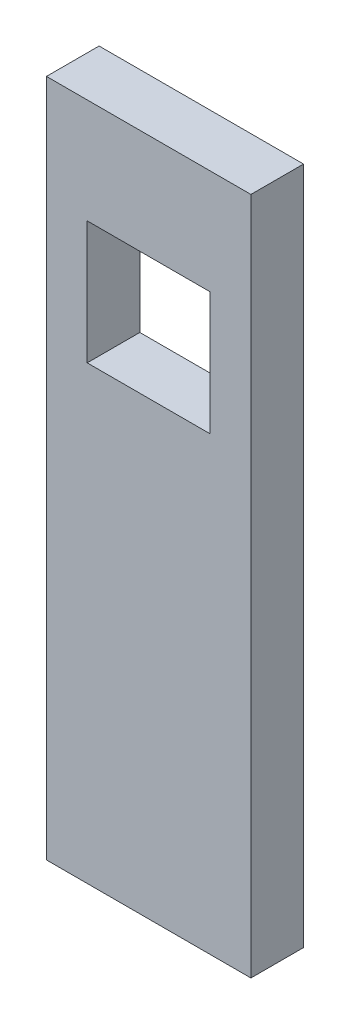
ISO-10303-21;
HEADER;
FILE_DESCRIPTION(('STEP AP214'),'2;1');
FILE_NAME('part.step','',(''),(''),'','','');
FILE_SCHEMA(('AUTOMOTIVE_DESIGN { 1 0 10303 214 1 1 1 1 }'));
ENDSEC;
DATA;
#1=APPLICATION_CONTEXT('core data for automotive mechanical design processes');
#2=APPLICATION_PROTOCOL_DEFINITION('international standard','automotive_design',2000,#1);
#3=PRODUCT_CONTEXT('',#1,'mechanical');
#4=PRODUCT('Part','Part','',(#3));
#5=PRODUCT_RELATED_PRODUCT_CATEGORY('part','',(#4));
#6=PRODUCT_DEFINITION_FORMATION('','',#4);
#7=PRODUCT_DEFINITION_CONTEXT('part definition',#1,'design');
#8=PRODUCT_DEFINITION('design','',#6,#7);
#9=PRODUCT_DEFINITION_SHAPE('','',#8);
#10=(LENGTH_UNIT() NAMED_UNIT(*) SI_UNIT(.MILLI.,.METRE.));
#11=(NAMED_UNIT(*) PLANE_ANGLE_UNIT() SI_UNIT($,.RADIAN.));
#12=(NAMED_UNIT(*) SI_UNIT($,.STERADIAN.) SOLID_ANGLE_UNIT());
#13=UNCERTAINTY_MEASURE_WITH_UNIT(LENGTH_MEASURE(1.E-05),#10,'distance_accuracy_value','');
#14=(GEOMETRIC_REPRESENTATION_CONTEXT(3) GLOBAL_UNCERTAINTY_ASSIGNED_CONTEXT((#13)) GLOBAL_UNIT_ASSIGNED_CONTEXT((#10,
#11,#12)) REPRESENTATION_CONTEXT('',''));
#15=CARTESIAN_POINT('',(0.,0.,0.));
#16=DIRECTION('',(0.,0.,1.));
#17=DIRECTION('',(1.,0.,0.));
#18=AXIS2_PLACEMENT_3D('',#15,#16,#17);
#19=CARTESIAN_POINT('',(0.,0.,2.6));
#20=DIRECTION('',(0.,0.,-1.));
#21=DIRECTION('',(-1.,0.,0.));
#22=AXIS2_PLACEMENT_3D('',#19,#20,#21);
#23=PLANE('',#22);
#24=DIRECTION('',(0.,-1.,0.));
#25=VECTOR('',#24,1.);
#26=CARTESIAN_POINT('',(-0.100000000000003,66.95,2.6));
#27=LINE('',#26,#25);
#28=CARTESIAN_POINT('',(-0.100000000000003,66.95,2.6));
#29=VERTEX_POINT('',#28);
#30=CARTESIAN_POINT('',(-0.0999999999999994,-0.100000000000003,2.6));
#31=VERTEX_POINT('',#30);
#32=EDGE_CURVE('E134',#29,#31,#27,.T.);
#33=ORIENTED_EDGE('',*,*,#32,.T.);
#34=DIRECTION('',(1.,0.,0.));
#35=VECTOR('',#34,1.);
#36=CARTESIAN_POINT('',(20.1,-0.100000000000003,2.6));
#37=LINE('',#36,#35);
#38=CARTESIAN_POINT('',(20.1,-0.100000000000003,2.6));
#39=VERTEX_POINT('',#38);
#40=EDGE_CURVE('E136',#31,#39,#37,.T.);
#41=ORIENTED_EDGE('',*,*,#40,.T.);
#42=DIRECTION('',(0.,1.,0.));
#43=VECTOR('',#42,1.);
#44=CARTESIAN_POINT('',(20.1,22.3,2.6));
#45=LINE('',#44,#43);
#46=CARTESIAN_POINT('',(20.1,66.95,2.6));
#47=VERTEX_POINT('',#46);
#48=EDGE_CURVE('E139',#39,#47,#45,.T.);
#49=ORIENTED_EDGE('',*,*,#48,.T.);
#50=DIRECTION('',(-1.,0.,0.));
#51=VECTOR('',#50,1.);
#52=CARTESIAN_POINT('',(-0.100000000000003,66.95,2.6));
#53=LINE('',#52,#51);
#54=EDGE_CURVE('E141',#47,#29,#53,.T.);
#55=ORIENTED_EDGE('',*,*,#54,.T.);
#56=EDGE_LOOP('',(#33,#41,#49,#55));
#57=FACE_BOUND('',#56,.T.);
#58=DIRECTION('',(0.,-1.,0.));
#59=VECTOR('',#58,1.);
#60=CARTESIAN_POINT('',(3.925,56.6,2.6));
#61=LINE('',#60,#59);
#62=CARTESIAN_POINT('',(3.925,56.6,2.6));
#63=VERTEX_POINT('',#62);
#64=CARTESIAN_POINT('',(3.925,44.45,2.6));
#65=VERTEX_POINT('',#64);
#66=EDGE_CURVE('E98',#63,#65,#61,.T.);
#67=ORIENTED_EDGE('',*,*,#66,.F.);
#68=DIRECTION('',(-1.,0.,0.));
#69=VECTOR('',#68,1.);
#70=CARTESIAN_POINT('',(3.925,56.6,2.6));
#71=LINE('',#70,#69);
#72=CARTESIAN_POINT('',(16.075,56.6,2.6));
#73=VERTEX_POINT('',#72);
#74=EDGE_CURVE('E120',#73,#63,#71,.T.);
#75=ORIENTED_EDGE('',*,*,#74,.F.);
#76=DIRECTION('',(0.,1.,0.));
#77=VECTOR('',#76,1.);
#78=CARTESIAN_POINT('',(16.075,56.6,2.6));
#79=LINE('',#78,#77);
#80=CARTESIAN_POINT('',(16.075,44.45,2.6));
#81=VERTEX_POINT('',#80);
#82=EDGE_CURVE('E118',#81,#73,#79,.T.);
#83=ORIENTED_EDGE('',*,*,#82,.F.);
#84=DIRECTION('',(1.,0.,0.));
#85=VECTOR('',#84,1.);
#86=CARTESIAN_POINT('',(3.925,44.45,2.6));
#87=LINE('',#86,#85);
#88=EDGE_CURVE('E106',#65,#81,#87,.T.);
#89=ORIENTED_EDGE('',*,*,#88,.F.);
#90=EDGE_LOOP('',(#67,#75,#83,#89));
#91=FACE_BOUND('',#90,.T.);
#92=ADVANCED_FACE('F33',(#57,#91),#23,.F.);
#93=CARTESIAN_POINT('',(0.,0.,-2.6));
#94=DIRECTION('',(0.,0.,-1.));
#95=DIRECTION('',(-1.,0.,0.));
#96=AXIS2_PLACEMENT_3D('',#93,#94,#95);
#97=PLANE('',#96);
#98=DIRECTION('',(0.,-1.,0.));
#99=VECTOR('',#98,1.);
#100=CARTESIAN_POINT('',(-0.0999999999999994,22.3,-2.6));
#101=LINE('',#100,#99);
#102=CARTESIAN_POINT('',(-0.100000000000003,66.95,-2.6));
#103=VERTEX_POINT('',#102);
#104=CARTESIAN_POINT('',(-0.0999999999999994,-0.100000000000003,-2.6));
#105=VERTEX_POINT('',#104);
#106=EDGE_CURVE('E114',#103,#105,#101,.T.);
#107=ORIENTED_EDGE('',*,*,#106,.F.);
#108=DIRECTION('',(-1.,0.,0.));
#109=VECTOR('',#108,1.);
#110=CARTESIAN_POINT('',(-0.100000000000003,66.95,-2.6));
#111=LINE('',#110,#109);
#112=CARTESIAN_POINT('',(20.1,66.95,-2.6));
#113=VERTEX_POINT('',#112);
#114=EDGE_CURVE('E137',#113,#103,#111,.T.);
#115=ORIENTED_EDGE('',*,*,#114,.F.);
#116=DIRECTION('',(0.,1.,0.));
#117=VECTOR('',#116,1.);
#118=CARTESIAN_POINT('',(20.1,66.95,-2.6));
#119=LINE('',#118,#117);
#120=CARTESIAN_POINT('',(20.1,-0.100000000000003,-2.6));
#121=VERTEX_POINT('',#120);
#122=EDGE_CURVE('E148',#121,#113,#119,.T.);
#123=ORIENTED_EDGE('',*,*,#122,.F.);
#124=DIRECTION('',(1.,0.,0.));
#125=VECTOR('',#124,1.);
#126=CARTESIAN_POINT('',(20.1,-0.100000000000003,-2.6));
#127=LINE('',#126,#125);
#128=EDGE_CURVE('E145',#105,#121,#127,.T.);
#129=ORIENTED_EDGE('',*,*,#128,.F.);
#130=EDGE_LOOP('',(#107,#115,#123,#129));
#131=FACE_BOUND('',#130,.T.);
#132=DIRECTION('',(-1.,0.,0.));
#133=VECTOR('',#132,1.);
#134=CARTESIAN_POINT('',(3.925,56.6,-2.6));
#135=LINE('',#134,#133);
#136=CARTESIAN_POINT('',(16.075,56.6,-2.6));
#137=VERTEX_POINT('',#136);
#138=CARTESIAN_POINT('',(3.925,56.6,-2.6));
#139=VERTEX_POINT('',#138);
#140=EDGE_CURVE('E107',#137,#139,#135,.T.);
#141=ORIENTED_EDGE('',*,*,#140,.T.);
#142=DIRECTION('',(0.,-1.,0.));
#143=VECTOR('',#142,1.);
#144=CARTESIAN_POINT('',(3.925,56.6,-2.6));
#145=LINE('',#144,#143);
#146=CARTESIAN_POINT('',(3.925,44.45,-2.6));
#147=VERTEX_POINT('',#146);
#148=EDGE_CURVE('E56',#139,#147,#145,.T.);
#149=ORIENTED_EDGE('',*,*,#148,.T.);
#150=DIRECTION('',(1.,0.,0.));
#151=VECTOR('',#150,1.);
#152=CARTESIAN_POINT('',(3.925,44.45,-2.6));
#153=LINE('',#152,#151);
#154=CARTESIAN_POINT('',(16.075,44.45,-2.6));
#155=VERTEX_POINT('',#154);
#156=EDGE_CURVE('E113',#147,#155,#153,.T.);
#157=ORIENTED_EDGE('',*,*,#156,.T.);
#158=DIRECTION('',(0.,1.,0.));
#159=VECTOR('',#158,1.);
#160=CARTESIAN_POINT('',(16.075,56.6,-2.6));
#161=LINE('',#160,#159);
#162=EDGE_CURVE('E126',#155,#137,#161,.T.);
#163=ORIENTED_EDGE('',*,*,#162,.T.);
#164=EDGE_LOOP('',(#141,#149,#157,#163));
#165=FACE_BOUND('',#164,.T.);
#166=ADVANCED_FACE('F168',(#131,#165),#97,.T.);
#167=CARTESIAN_POINT('',(-0.0999999999999994,22.3,2.6));
#168=DIRECTION('',(1.,0.,0.));
#169=DIRECTION('',(0.,0.,-1.));
#170=AXIS2_PLACEMENT_3D('',#167,#168,#169);
#171=PLANE('',#170);
#172=ORIENTED_EDGE('',*,*,#106,.T.);
#173=DIRECTION('',(0.,0.,-1.));
#174=VECTOR('',#173,1.);
#175=CARTESIAN_POINT('',(-0.0999999999999994,-0.100000000000003,2.6));
#176=LINE('',#175,#174);
#177=EDGE_CURVE('E11',#31,#105,#176,.T.);
#178=ORIENTED_EDGE('',*,*,#177,.F.);
#179=ORIENTED_EDGE('',*,*,#32,.F.);
#180=DIRECTION('',(0.,0.,-1.));
#181=VECTOR('',#180,1.);
#182=CARTESIAN_POINT('',(-0.100000000000003,66.95,2.6));
#183=LINE('',#182,#181);
#184=EDGE_CURVE('E143',#29,#103,#183,.T.);
#185=ORIENTED_EDGE('',*,*,#184,.T.);
#186=EDGE_LOOP('',(#172,#178,#179,#185));
#187=FACE_BOUND('',#186,.T.);
#188=ADVANCED_FACE('F35',(#187),#171,.F.);
#189=CARTESIAN_POINT('',(20.1,-0.100000000000003,2.6));
#190=DIRECTION('',(0.,1.,0.));
#191=DIRECTION('',(-1.,0.,0.));
#192=AXIS2_PLACEMENT_3D('',#189,#190,#191);
#193=PLANE('',#192);
#194=ORIENTED_EDGE('',*,*,#128,.T.);
#195=DIRECTION('',(0.,0.,-1.));
#196=VECTOR('',#195,1.);
#197=CARTESIAN_POINT('',(20.1,-0.100000000000003,2.6));
#198=LINE('',#197,#196);
#199=EDGE_CURVE('E41',#39,#121,#198,.T.);
#200=ORIENTED_EDGE('',*,*,#199,.F.);
#201=ORIENTED_EDGE('',*,*,#40,.F.);
#202=ORIENTED_EDGE('',*,*,#177,.T.);
#203=EDGE_LOOP('',(#194,#200,#201,#202));
#204=FACE_BOUND('',#203,.T.);
#205=ADVANCED_FACE('F164',(#204),#193,.F.);
#206=CARTESIAN_POINT('',(20.1,66.95,2.6));
#207=DIRECTION('',(-1.,0.,0.));
#208=DIRECTION('',(0.,0.,1.));
#209=AXIS2_PLACEMENT_3D('',#206,#207,#208);
#210=PLANE('',#209);
#211=ORIENTED_EDGE('',*,*,#122,.T.);
#212=DIRECTION('',(0.,0.,-1.));
#213=VECTOR('',#212,1.);
#214=CARTESIAN_POINT('',(20.1,66.95,2.6));
#215=LINE('',#214,#213);
#216=EDGE_CURVE('E154',#47,#113,#215,.T.);
#217=ORIENTED_EDGE('',*,*,#216,.F.);
#218=ORIENTED_EDGE('',*,*,#48,.F.);
#219=ORIENTED_EDGE('',*,*,#199,.T.);
#220=EDGE_LOOP('',(#211,#217,#218,#219));
#221=FACE_BOUND('',#220,.T.);
#222=ADVANCED_FACE('F160',(#221),#210,.F.);
#223=CARTESIAN_POINT('',(-0.100000000000003,66.95,2.6));
#224=DIRECTION('',(0.,-1.,0.));
#225=DIRECTION('',(0.,0.,-1.));
#226=AXIS2_PLACEMENT_3D('',#223,#224,#225);
#227=PLANE('',#226);
#228=ORIENTED_EDGE('',*,*,#114,.T.);
#229=ORIENTED_EDGE('',*,*,#184,.F.);
#230=ORIENTED_EDGE('',*,*,#54,.F.);
#231=ORIENTED_EDGE('',*,*,#216,.T.);
#232=EDGE_LOOP('',(#228,#229,#230,#231));
#233=FACE_BOUND('',#232,.T.);
#234=ADVANCED_FACE('F173',(#233),#227,.F.);
#235=CARTESIAN_POINT('',(3.925,56.6,2.6));
#236=DIRECTION('',(1.,0.,0.));
#237=DIRECTION('',(0.,1.,0.));
#238=AXIS2_PLACEMENT_3D('',#235,#236,#237);
#239=PLANE('',#238);
#240=ORIENTED_EDGE('',*,*,#148,.F.);
#241=DIRECTION('',(0.,0.,-1.));
#242=VECTOR('',#241,1.);
#243=CARTESIAN_POINT('',(3.925,56.6,2.6));
#244=LINE('',#243,#242);
#245=EDGE_CURVE('E102',#63,#139,#244,.T.);
#246=ORIENTED_EDGE('',*,*,#245,.F.);
#247=ORIENTED_EDGE('',*,*,#66,.T.);
#248=DIRECTION('',(0.,0.,-1.));
#249=VECTOR('',#248,1.);
#250=CARTESIAN_POINT('',(3.925,44.45,2.6));
#251=LINE('',#250,#249);
#252=EDGE_CURVE('E101',#65,#147,#251,.T.);
#253=ORIENTED_EDGE('',*,*,#252,.T.);
#254=EDGE_LOOP('',(#240,#246,#247,#253));
#255=FACE_BOUND('',#254,.T.);
#256=ADVANCED_FACE('F100',(#255),#239,.T.);
#257=CARTESIAN_POINT('',(3.925,44.45,2.6));
#258=DIRECTION('',(0.,1.,0.));
#259=DIRECTION('',(0.,0.,1.));
#260=AXIS2_PLACEMENT_3D('',#257,#258,#259);
#261=PLANE('',#260);
#262=ORIENTED_EDGE('',*,*,#156,.F.);
#263=ORIENTED_EDGE('',*,*,#252,.F.);
#264=ORIENTED_EDGE('',*,*,#88,.T.);
#265=DIRECTION('',(0.,0.,-1.));
#266=VECTOR('',#265,1.);
#267=CARTESIAN_POINT('',(16.075,44.45,2.6));
#268=LINE('',#267,#266);
#269=EDGE_CURVE('E115',#81,#155,#268,.T.);
#270=ORIENTED_EDGE('',*,*,#269,.T.);
#271=EDGE_LOOP('',(#262,#263,#264,#270));
#272=FACE_BOUND('',#271,.T.);
#273=ADVANCED_FACE('F110',(#272),#261,.T.);
#274=CARTESIAN_POINT('',(16.075,56.6,2.6));
#275=DIRECTION('',(-1.,0.,0.));
#276=DIRECTION('',(0.,0.,1.));
#277=AXIS2_PLACEMENT_3D('',#274,#275,#276);
#278=PLANE('',#277);
#279=ORIENTED_EDGE('',*,*,#162,.F.);
#280=ORIENTED_EDGE('',*,*,#269,.F.);
#281=ORIENTED_EDGE('',*,*,#82,.T.);
#282=DIRECTION('',(0.,0.,-1.));
#283=VECTOR('',#282,1.);
#284=CARTESIAN_POINT('',(16.075,56.6,2.6));
#285=LINE('',#284,#283);
#286=EDGE_CURVE('E48',#73,#137,#285,.T.);
#287=ORIENTED_EDGE('',*,*,#286,.T.);
#288=EDGE_LOOP('',(#279,#280,#281,#287));
#289=FACE_BOUND('',#288,.T.);
#290=ADVANCED_FACE('F260',(#289),#278,.T.);
#291=CARTESIAN_POINT('',(3.925,56.6,2.6));
#292=DIRECTION('',(0.,-1.,0.));
#293=DIRECTION('',(0.,0.,-1.));
#294=AXIS2_PLACEMENT_3D('',#291,#292,#293);
#295=PLANE('',#294);
#296=ORIENTED_EDGE('',*,*,#140,.F.);
#297=ORIENTED_EDGE('',*,*,#286,.F.);
#298=ORIENTED_EDGE('',*,*,#74,.T.);
#299=ORIENTED_EDGE('',*,*,#245,.T.);
#300=EDGE_LOOP('',(#296,#297,#298,#299));
#301=FACE_BOUND('',#300,.T.);
#302=ADVANCED_FACE('F267',(#301),#295,.T.);
#303=CLOSED_SHELL('',(#92,#166,#188,#205,#222,#234,#256,#273,#290,#302));
#304=MANIFOLD_SOLID_BREP('B2',#303);
#305=ADVANCED_BREP_SHAPE_REPRESENTATION('',(#18,#304),#14);
#306=SHAPE_DEFINITION_REPRESENTATION(#9,#305);
ENDSEC;
END-ISO-10303-21;
